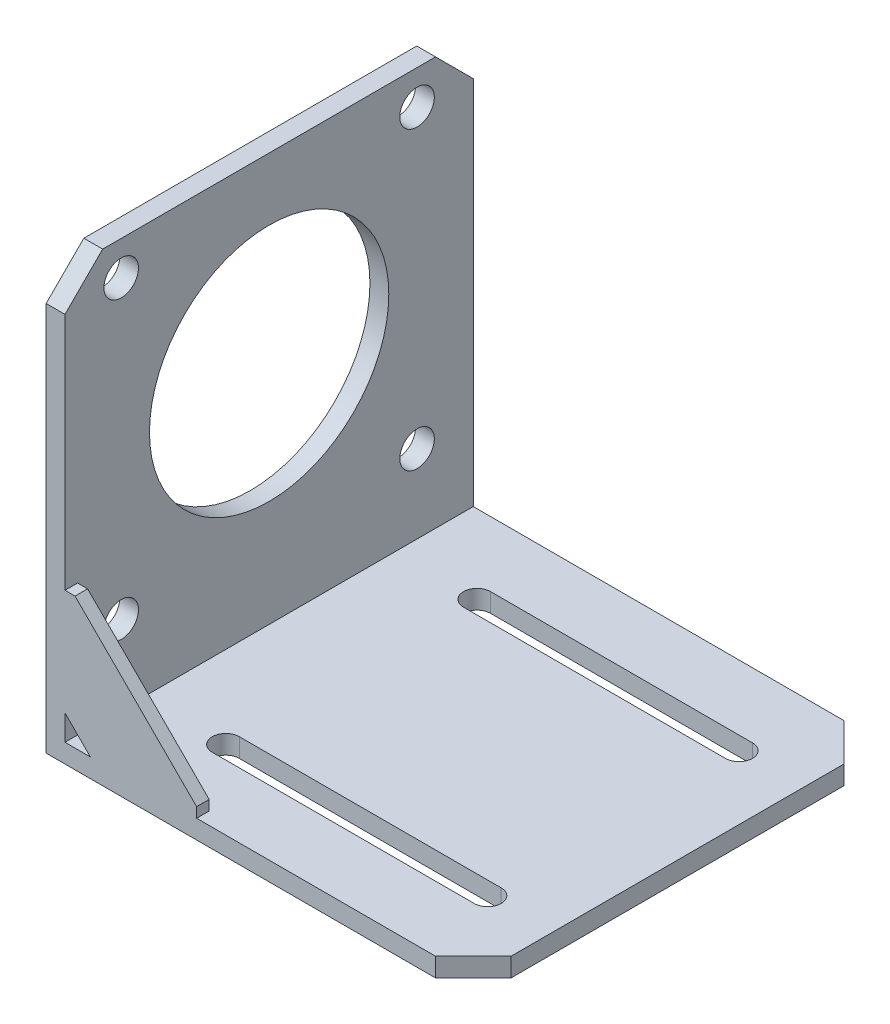
ISO-10303-21;
HEADER;
FILE_DESCRIPTION(('STEP AP214'),'2;1');
FILE_NAME('part.step','',(''),(''),'','','');
FILE_SCHEMA(('AUTOMOTIVE_DESIGN { 1 0 10303 214 1 1 1 1 }'));
ENDSEC;
DATA;
#1=APPLICATION_CONTEXT('core data for automotive mechanical design processes');
#2=APPLICATION_PROTOCOL_DEFINITION('international standard','automotive_design',2000,#1);
#3=PRODUCT_CONTEXT('',#1,'mechanical');
#4=PRODUCT('Part','Part','',(#3));
#5=PRODUCT_RELATED_PRODUCT_CATEGORY('part','',(#4));
#6=PRODUCT_DEFINITION_FORMATION('','',#4);
#7=PRODUCT_DEFINITION_CONTEXT('part definition',#1,'design');
#8=PRODUCT_DEFINITION('design','',#6,#7);
#9=PRODUCT_DEFINITION_SHAPE('','',#8);
#10=(LENGTH_UNIT() NAMED_UNIT(*) SI_UNIT(.MILLI.,.METRE.));
#11=(NAMED_UNIT(*) PLANE_ANGLE_UNIT() SI_UNIT($,.RADIAN.));
#12=(NAMED_UNIT(*) SI_UNIT($,.STERADIAN.) SOLID_ANGLE_UNIT());
#13=UNCERTAINTY_MEASURE_WITH_UNIT(LENGTH_MEASURE(1.E-05),#10,'distance_accuracy_value','');
#14=(GEOMETRIC_REPRESENTATION_CONTEXT(3) GLOBAL_UNCERTAINTY_ASSIGNED_CONTEXT((#13)) GLOBAL_UNIT_ASSIGNED_CONTEXT((#10,
#11,#12)) REPRESENTATION_CONTEXT('',''));
#15=CARTESIAN_POINT('',(0.,0.,0.));
#16=DIRECTION('',(0.,0.,1.));
#17=DIRECTION('',(1.,0.,0.));
#18=AXIS2_PLACEMENT_3D('',#15,#16,#17);
#19=CARTESIAN_POINT('',(68.,0.,65.));
#20=DIRECTION('',(0.,1.,0.));
#21=DIRECTION('',(-1.,0.,0.));
#22=AXIS2_PLACEMENT_3D('',#19,#20,#21);
#23=PLANE('',#22);
#24=DIRECTION('',(1.,0.,0.));
#25=VECTOR('',#24,1.);
#26=CARTESIAN_POINT('',(16.1,0.,10.35));
#27=LINE('',#26,#25);
#28=CARTESIAN_POINT('',(16.1,0.,10.35));
#29=VERTEX_POINT('',#28);
#30=CARTESIAN_POINT('',(57.8,0.,10.35));
#31=VERTEX_POINT('',#30);
#32=EDGE_CURVE('E223',#29,#31,#27,.T.);
#33=ORIENTED_EDGE('',*,*,#32,.F.);
#34=CARTESIAN_POINT('',(16.1,0.,12.5));
#35=DIRECTION('',(0.,-1.,0.));
#36=DIRECTION('',(1.,0.,0.));
#37=AXIS2_PLACEMENT_3D('',#34,#35,#36);
#38=CIRCLE('',#37,2.15);
#39=CARTESIAN_POINT('',(16.1,0.,14.65));
#40=VERTEX_POINT('',#39);
#41=EDGE_CURVE('E51',#40,#29,#38,.T.);
#42=ORIENTED_EDGE('',*,*,#41,.F.);
#43=DIRECTION('',(-1.,0.,0.));
#44=VECTOR('',#43,1.);
#45=CARTESIAN_POINT('',(16.1,0.,14.65));
#46=LINE('',#45,#44);
#47=CARTESIAN_POINT('',(57.8,0.,14.65));
#48=VERTEX_POINT('',#47);
#49=EDGE_CURVE('E214',#48,#40,#46,.T.);
#50=ORIENTED_EDGE('',*,*,#49,.F.);
#51=CARTESIAN_POINT('',(57.8,0.,12.5));
#52=DIRECTION('',(0.,-1.,0.));
#53=DIRECTION('',(1.,0.,0.));
#54=AXIS2_PLACEMENT_3D('',#51,#52,#53);
#55=CIRCLE('',#54,2.15);
#56=EDGE_CURVE('E217',#31,#48,#55,.T.);
#57=ORIENTED_EDGE('',*,*,#56,.F.);
#58=EDGE_LOOP('',(#33,#42,#50,#57));
#59=FACE_BOUND('',#58,.T.);
#60=DIRECTION('',(1.,0.,0.));
#61=VECTOR('',#60,1.);
#62=CARTESIAN_POINT('',(16.1,0.,50.35));
#63=LINE('',#62,#61);
#64=CARTESIAN_POINT('',(16.1,0.,50.35));
#65=VERTEX_POINT('',#64);
#66=CARTESIAN_POINT('',(57.8,0.,50.35));
#67=VERTEX_POINT('',#66);
#68=EDGE_CURVE('E248',#65,#67,#63,.T.);
#69=ORIENTED_EDGE('',*,*,#68,.F.);
#70=CARTESIAN_POINT('',(16.1,0.,52.5));
#71=DIRECTION('',(0.,-1.,0.));
#72=DIRECTION('',(1.,0.,0.));
#73=AXIS2_PLACEMENT_3D('',#70,#71,#72);
#74=CIRCLE('',#73,2.15);
#75=CARTESIAN_POINT('',(16.1,0.,54.65));
#76=VERTEX_POINT('',#75);
#77=EDGE_CURVE('E229',#76,#65,#74,.T.);
#78=ORIENTED_EDGE('',*,*,#77,.F.);
#79=DIRECTION('',(-1.,0.,0.));
#80=VECTOR('',#79,1.);
#81=CARTESIAN_POINT('',(16.1,0.,54.65));
#82=LINE('',#81,#80);
#83=CARTESIAN_POINT('',(57.8,0.,54.65));
#84=VERTEX_POINT('',#83);
#85=EDGE_CURVE('E237',#84,#76,#82,.T.);
#86=ORIENTED_EDGE('',*,*,#85,.F.);
#87=CARTESIAN_POINT('',(57.8,0.,52.5));
#88=DIRECTION('',(0.,-1.,0.));
#89=DIRECTION('',(1.,0.,0.));
#90=AXIS2_PLACEMENT_3D('',#87,#88,#89);
#91=CIRCLE('',#90,2.15);
#92=EDGE_CURVE('E251',#67,#84,#91,.T.);
#93=ORIENTED_EDGE('',*,*,#92,.F.);
#94=EDGE_LOOP('',(#69,#78,#86,#93));
#95=FACE_BOUND('',#94,.T.);
#96=DIRECTION('',(0.,0.,-1.));
#97=VECTOR('',#96,1.);
#98=CARTESIAN_POINT('',(68.,0.,65.));
#99=LINE('',#98,#97);
#100=CARTESIAN_POINT('',(68.,0.,59.));
#101=VERTEX_POINT('',#100);
#102=CARTESIAN_POINT('',(68.,0.,6.));
#103=VERTEX_POINT('',#102);
#104=EDGE_CURVE('E375',#101,#103,#99,.T.);
#105=ORIENTED_EDGE('',*,*,#104,.F.);
#106=DIRECTION('',(0.707106781186546,0.,-0.707106781186549));
#107=VECTOR('',#106,1.);
#108=CARTESIAN_POINT('',(62.,0.,65.));
#109=LINE('',#108,#107);
#110=CARTESIAN_POINT('',(62.,0.,65.));
#111=VERTEX_POINT('',#110);
#112=EDGE_CURVE('E395',#101,#111,#109,.F.);
#113=ORIENTED_EDGE('',*,*,#112,.T.);
#114=DIRECTION('',(1.,0.,0.));
#115=VECTOR('',#114,1.);
#116=CARTESIAN_POINT('',(68.,0.,65.));
#117=LINE('',#116,#115);
#118=CARTESIAN_POINT('',(0.,0.,65.));
#119=VERTEX_POINT('',#118);
#120=EDGE_CURVE('E338',#119,#111,#117,.T.);
#121=ORIENTED_EDGE('',*,*,#120,.F.);
#122=DIRECTION('',(0.,0.,-1.));
#123=VECTOR('',#122,1.);
#124=CARTESIAN_POINT('',(0.,0.,65.));
#125=LINE('',#124,#123);
#126=CARTESIAN_POINT('',(0.,0.,0.));
#127=VERTEX_POINT('',#126);
#128=EDGE_CURVE('E352',#119,#127,#125,.T.);
#129=ORIENTED_EDGE('',*,*,#128,.T.);
#130=DIRECTION('',(1.,0.,0.));
#131=VECTOR('',#130,1.);
#132=CARTESIAN_POINT('',(68.,0.,0.));
#133=LINE('',#132,#131);
#134=CARTESIAN_POINT('',(62.,0.,0.));
#135=VERTEX_POINT('',#134);
#136=EDGE_CURVE('E325',#127,#135,#133,.T.);
#137=ORIENTED_EDGE('',*,*,#136,.T.);
#138=DIRECTION('',(0.70710678118655,0.,0.707106781186546));
#139=VECTOR('',#138,1.);
#140=CARTESIAN_POINT('',(68.,0.,6.));
#141=LINE('',#140,#139);
#142=EDGE_CURVE('E393',#135,#103,#141,.T.);
#143=ORIENTED_EDGE('',*,*,#142,.T.);
#144=EDGE_LOOP('',(#105,#113,#121,#129,#137,#143));
#145=FACE_BOUND('',#144,.T.);
#146=ADVANCED_FACE('F36',(#59,#95,#145),#23,.F.);
#147=CARTESIAN_POINT('',(68.,3.,65.));
#148=DIRECTION('',(-1.,0.,0.));
#149=DIRECTION('',(0.,-1.,0.));
#150=AXIS2_PLACEMENT_3D('',#147,#148,#149);
#151=PLANE('',#150);
#152=DIRECTION('',(0.,0.,-1.));
#153=VECTOR('',#152,1.);
#154=CARTESIAN_POINT('',(68.,3.,65.));
#155=LINE('',#154,#153);
#156=CARTESIAN_POINT('',(68.,3.,59.));
#157=VERTEX_POINT('',#156);
#158=CARTESIAN_POINT('',(68.,3.,6.));
#159=VERTEX_POINT('',#158);
#160=EDGE_CURVE('E372',#157,#159,#155,.T.);
#161=ORIENTED_EDGE('',*,*,#160,.F.);
#162=DIRECTION('',(0.,-1.,0.));
#163=VECTOR('',#162,1.);
#164=CARTESIAN_POINT('',(68.,3.,59.));
#165=LINE('',#164,#163);
#166=EDGE_CURVE('E391',#157,#101,#165,.T.);
#167=ORIENTED_EDGE('',*,*,#166,.T.);
#168=ORIENTED_EDGE('',*,*,#104,.T.);
#169=DIRECTION('',(0.,1.,0.));
#170=VECTOR('',#169,1.);
#171=CARTESIAN_POINT('',(68.,3.,5.99999999999999));
#172=LINE('',#171,#170);
#173=EDGE_CURVE('E388',#103,#159,#172,.T.);
#174=ORIENTED_EDGE('',*,*,#173,.T.);
#175=EDGE_LOOP('',(#161,#167,#168,#174));
#176=FACE_BOUND('',#175,.T.);
#177=ADVANCED_FACE('F441',(#176),#151,.F.);
#178=CARTESIAN_POINT('',(3.,3.,65.));
#179=DIRECTION('',(0.,-1.,0.));
#180=DIRECTION('',(1.,0.,0.));
#181=AXIS2_PLACEMENT_3D('',#178,#179,#180);
#182=PLANE('',#181);
#183=DIRECTION('',(-1.,0.,0.));
#184=VECTOR('',#183,1.);
#185=CARTESIAN_POINT('',(16.1,3.,14.65));
#186=LINE('',#185,#184);
#187=CARTESIAN_POINT('',(57.8,3.,14.65));
#188=VERTEX_POINT('',#187);
#189=CARTESIAN_POINT('',(16.1,3.,14.65));
#190=VERTEX_POINT('',#189);
#191=EDGE_CURVE('E204',#188,#190,#186,.T.);
#192=ORIENTED_EDGE('',*,*,#191,.T.);
#193=CARTESIAN_POINT('',(16.1,3.,12.5));
#194=DIRECTION('',(0.,-1.,0.));
#195=DIRECTION('',(1.,0.,0.));
#196=AXIS2_PLACEMENT_3D('',#193,#194,#195);
#197=CIRCLE('',#196,2.15);
#198=CARTESIAN_POINT('',(16.1,3.,10.35));
#199=VERTEX_POINT('',#198);
#200=EDGE_CURVE('E198',#190,#199,#197,.T.);
#201=ORIENTED_EDGE('',*,*,#200,.T.);
#202=DIRECTION('',(1.,0.,0.));
#203=VECTOR('',#202,1.);
#204=CARTESIAN_POINT('',(16.1,3.,10.35));
#205=LINE('',#204,#203);
#206=CARTESIAN_POINT('',(57.8,3.,10.35));
#207=VERTEX_POINT('',#206);
#208=EDGE_CURVE('E207',#199,#207,#205,.T.);
#209=ORIENTED_EDGE('',*,*,#208,.T.);
#210=CARTESIAN_POINT('',(57.8,3.,12.5));
#211=DIRECTION('',(0.,-1.,0.));
#212=DIRECTION('',(1.,0.,0.));
#213=AXIS2_PLACEMENT_3D('',#210,#211,#212);
#214=CIRCLE('',#213,2.15);
#215=EDGE_CURVE('E59',#207,#188,#214,.T.);
#216=ORIENTED_EDGE('',*,*,#215,.T.);
#217=EDGE_LOOP('',(#192,#201,#209,#216));
#218=FACE_BOUND('',#217,.T.);
#219=DIRECTION('',(-1.,0.,0.));
#220=VECTOR('',#219,1.);
#221=CARTESIAN_POINT('',(16.1,3.,54.65));
#222=LINE('',#221,#220);
#223=CARTESIAN_POINT('',(57.8,3.,54.65));
#224=VERTEX_POINT('',#223);
#225=CARTESIAN_POINT('',(16.1,3.,54.65));
#226=VERTEX_POINT('',#225);
#227=EDGE_CURVE('E243',#224,#226,#222,.T.);
#228=ORIENTED_EDGE('',*,*,#227,.T.);
#229=CARTESIAN_POINT('',(16.1,3.,52.5));
#230=DIRECTION('',(0.,-1.,0.));
#231=DIRECTION('',(1.,0.,0.));
#232=AXIS2_PLACEMENT_3D('',#229,#230,#231);
#233=CIRCLE('',#232,2.15);
#234=CARTESIAN_POINT('',(16.1,3.,50.35));
#235=VERTEX_POINT('',#234);
#236=EDGE_CURVE('E233',#226,#235,#233,.T.);
#237=ORIENTED_EDGE('',*,*,#236,.T.);
#238=DIRECTION('',(1.,0.,0.));
#239=VECTOR('',#238,1.);
#240=CARTESIAN_POINT('',(16.1,3.,50.35));
#241=LINE('',#240,#239);
#242=CARTESIAN_POINT('',(57.8,3.,50.35));
#243=VERTEX_POINT('',#242);
#244=EDGE_CURVE('E236',#235,#243,#241,.T.);
#245=ORIENTED_EDGE('',*,*,#244,.T.);
#246=CARTESIAN_POINT('',(57.8,3.,52.5));
#247=DIRECTION('',(0.,-1.,0.));
#248=DIRECTION('',(1.,0.,0.));
#249=AXIS2_PLACEMENT_3D('',#246,#247,#248);
#250=CIRCLE('',#249,2.15);
#251=EDGE_CURVE('E240',#243,#224,#250,.T.);
#252=ORIENTED_EDGE('',*,*,#251,.T.);
#253=EDGE_LOOP('',(#228,#237,#245,#252));
#254=FACE_BOUND('',#253,.T.);
#255=DIRECTION('',(-1.,0.,0.));
#256=VECTOR('',#255,1.);
#257=CARTESIAN_POINT('',(3.,3.,65.));
#258=LINE('',#257,#256);
#259=CARTESIAN_POINT('',(7.04782201567098,3.,65.));
#260=VERTEX_POINT('',#259);
#261=CARTESIAN_POINT('',(3.,3.,65.));
#262=VERTEX_POINT('',#261);
#263=EDGE_CURVE('E341',#260,#262,#258,.T.);
#264=ORIENTED_EDGE('',*,*,#263,.F.);
#265=DIRECTION('',(0.,0.,1.));
#266=VECTOR('',#265,1.);
#267=CARTESIAN_POINT('',(7.04782201567098,3.00000000000002,63.));
#268=LINE('',#267,#266);
#269=CARTESIAN_POINT('',(7.04782201567098,3.00000000000002,63.));
#270=VERTEX_POINT('',#269);
#271=EDGE_CURVE('E313',#270,#260,#268,.T.);
#272=ORIENTED_EDGE('',*,*,#271,.F.);
#273=DIRECTION('',(1.,0.,0.));
#274=VECTOR('',#273,1.);
#275=CARTESIAN_POINT('',(23.9558780924768,3.00000000000002,63.));
#276=LINE('',#275,#274);
#277=CARTESIAN_POINT('',(23.9558780924768,3.00000000000002,63.));
#278=VERTEX_POINT('',#277);
#279=EDGE_CURVE('E298',#270,#278,#276,.T.);
#280=ORIENTED_EDGE('',*,*,#279,.T.);
#281=DIRECTION('',(0.,0.,1.));
#282=VECTOR('',#281,1.);
#283=CARTESIAN_POINT('',(23.9558780924768,3.00000000000002,63.));
#284=LINE('',#283,#282);
#285=CARTESIAN_POINT('',(23.9558780924768,3.00000000000002,65.));
#286=VERTEX_POINT('',#285);
#287=EDGE_CURVE('E333',#278,#286,#284,.T.);
#288=ORIENTED_EDGE('',*,*,#287,.T.);
#289=CARTESIAN_POINT('',(62.,3.,65.));
#290=VERTEX_POINT('',#289);
#291=EDGE_CURVE('E343',#290,#286,#258,.T.);
#292=ORIENTED_EDGE('',*,*,#291,.F.);
#293=DIRECTION('',(-0.707106781186546,0.,0.707106781186549));
#294=VECTOR('',#293,1.);
#295=CARTESIAN_POINT('',(62.,3.,65.));
#296=LINE('',#295,#294);
#297=EDGE_CURVE('E386',#290,#157,#296,.F.);
#298=ORIENTED_EDGE('',*,*,#297,.T.);
#299=ORIENTED_EDGE('',*,*,#160,.T.);
#300=DIRECTION('',(-0.70710678118655,0.,-0.707106781186546));
#301=VECTOR('',#300,1.);
#302=CARTESIAN_POINT('',(68.,3.,5.99999999999999));
#303=LINE('',#302,#301);
#304=CARTESIAN_POINT('',(62.,3.,0.));
#305=VERTEX_POINT('',#304);
#306=EDGE_CURVE('E384',#159,#305,#303,.T.);
#307=ORIENTED_EDGE('',*,*,#306,.T.);
#308=DIRECTION('',(-1.,0.,0.));
#309=VECTOR('',#308,1.);
#310=CARTESIAN_POINT('',(3.,3.,0.));
#311=LINE('',#310,#309);
#312=CARTESIAN_POINT('',(3.,3.,0.));
#313=VERTEX_POINT('',#312);
#314=EDGE_CURVE('E355',#305,#313,#311,.T.);
#315=ORIENTED_EDGE('',*,*,#314,.T.);
#316=DIRECTION('',(0.,0.,-1.));
#317=VECTOR('',#316,1.);
#318=CARTESIAN_POINT('',(3.,3.,65.));
#319=LINE('',#318,#317);
#320=EDGE_CURVE('E369',#262,#313,#319,.T.);
#321=ORIENTED_EDGE('',*,*,#320,.F.);
#322=EDGE_LOOP('',(#264,#272,#280,#288,#292,#298,#299,#307,#315,#321));
#323=FACE_BOUND('',#322,.T.);
#324=ADVANCED_FACE('F211',(#218,#254,#323),#182,.F.);
#325=CARTESIAN_POINT('',(3.,68.,65.));
#326=DIRECTION('',(-1.,0.,0.));
#327=DIRECTION('',(0.,-1.,0.));
#328=AXIS2_PLACEMENT_3D('',#325,#326,#327);
#329=PLANE('',#328);
#330=CARTESIAN_POINT('',(3.,15.45,56.05));
#331=DIRECTION('',(-1.,0.,0.));
#332=DIRECTION('',(0.,0.,1.));
#333=AXIS2_PLACEMENT_3D('',#330,#331,#332);
#334=CIRCLE('',#333,2.75);
#335=CARTESIAN_POINT('',(3.,15.45,58.8));
#336=VERTEX_POINT('',#335);
#337=EDGE_CURVE('E265',#336,#336,#334,.T.);
#338=ORIENTED_EDGE('',*,*,#337,.T.);
#339=EDGE_LOOP('',(#338));
#340=FACE_BOUND('',#339,.T.);
#341=CARTESIAN_POINT('',(3.,15.45,8.94999999999999));
#342=DIRECTION('',(-1.,0.,0.));
#343=DIRECTION('',(0.,0.,1.));
#344=AXIS2_PLACEMENT_3D('',#341,#342,#343);
#345=CIRCLE('',#344,2.75);
#346=CARTESIAN_POINT('',(3.,15.45,11.7));
#347=VERTEX_POINT('',#346);
#348=EDGE_CURVE('E271',#347,#347,#345,.T.);
#349=ORIENTED_EDGE('',*,*,#348,.T.);
#350=EDGE_LOOP('',(#349));
#351=FACE_BOUND('',#350,.T.);
#352=CARTESIAN_POINT('',(3.,62.55,56.05));
#353=DIRECTION('',(-1.,0.,0.));
#354=DIRECTION('',(0.,0.,1.));
#355=AXIS2_PLACEMENT_3D('',#352,#353,#354);
#356=CIRCLE('',#355,2.75);
#357=CARTESIAN_POINT('',(3.,62.55,58.8));
#358=VERTEX_POINT('',#357);
#359=EDGE_CURVE('E277',#358,#358,#356,.T.);
#360=ORIENTED_EDGE('',*,*,#359,.T.);
#361=EDGE_LOOP('',(#360));
#362=FACE_BOUND('',#361,.T.);
#363=CARTESIAN_POINT('',(3.,62.55,8.94999999999998));
#364=DIRECTION('',(-1.,0.,0.));
#365=DIRECTION('',(0.,0.,1.));
#366=AXIS2_PLACEMENT_3D('',#363,#364,#365);
#367=CIRCLE('',#366,2.75);
#368=CARTESIAN_POINT('',(3.,62.55,11.7));
#369=VERTEX_POINT('',#368);
#370=EDGE_CURVE('E283',#369,#369,#367,.T.);
#371=ORIENTED_EDGE('',*,*,#370,.T.);
#372=EDGE_LOOP('',(#371));
#373=FACE_BOUND('',#372,.T.);
#374=CARTESIAN_POINT('',(3.,39.,32.5));
#375=DIRECTION('',(-1.,0.,0.));
#376=DIRECTION('',(0.,0.,1.));
#377=AXIS2_PLACEMENT_3D('',#374,#375,#376);
#378=CIRCLE('',#377,19.05);
#379=CARTESIAN_POINT('',(3.,39.,51.55));
#380=VERTEX_POINT('',#379);
#381=EDGE_CURVE('E289',#380,#380,#378,.T.);
#382=ORIENTED_EDGE('',*,*,#381,.T.);
#383=EDGE_LOOP('',(#382));
#384=FACE_BOUND('',#383,.T.);
#385=DIRECTION('',(0.,-1.,0.));
#386=VECTOR('',#385,1.);
#387=CARTESIAN_POINT('',(3.,7.04782201567103,63.));
#388=LINE('',#387,#386);
#389=CARTESIAN_POINT('',(3.00000000000002,23.9558780924771,63.));
#390=VERTEX_POINT('',#389);
#391=CARTESIAN_POINT('',(3.,7.04782201567103,63.));
#392=VERTEX_POINT('',#391);
#393=EDGE_CURVE('E310',#390,#392,#388,.T.);
#394=ORIENTED_EDGE('',*,*,#393,.T.);
#395=DIRECTION('',(0.,0.,1.));
#396=VECTOR('',#395,1.);
#397=CARTESIAN_POINT('',(3.,7.04782201567103,63.));
#398=LINE('',#397,#396);
#399=CARTESIAN_POINT('',(3.,7.04782201567103,65.));
#400=VERTEX_POINT('',#399);
#401=EDGE_CURVE('E322',#392,#400,#398,.T.);
#402=ORIENTED_EDGE('',*,*,#401,.T.);
#403=DIRECTION('',(0.,1.,0.));
#404=VECTOR('',#403,1.);
#405=CARTESIAN_POINT('',(3.,68.,65.));
#406=LINE('',#405,#404);
#407=EDGE_CURVE('E347',#262,#400,#406,.T.);
#408=ORIENTED_EDGE('',*,*,#407,.F.);
#409=ORIENTED_EDGE('',*,*,#320,.T.);
#410=DIRECTION('',(0.,1.,0.));
#411=VECTOR('',#410,1.);
#412=CARTESIAN_POINT('',(3.,68.,0.));
#413=LINE('',#412,#411);
#414=CARTESIAN_POINT('',(3.,62.,0.));
#415=VERTEX_POINT('',#414);
#416=EDGE_CURVE('E357',#313,#415,#413,.T.);
#417=ORIENTED_EDGE('',*,*,#416,.T.);
#418=DIRECTION('',(0.,0.70710678118655,0.707106781186546));
#419=VECTOR('',#418,1.);
#420=CARTESIAN_POINT('',(3.,68.,5.99999999999999));
#421=LINE('',#420,#419);
#422=CARTESIAN_POINT('',(3.,68.,6.));
#423=VERTEX_POINT('',#422);
#424=EDGE_CURVE('E11',#415,#423,#421,.T.);
#425=ORIENTED_EDGE('',*,*,#424,.T.);
#426=DIRECTION('',(0.,0.,-1.));
#427=VECTOR('',#426,1.);
#428=CARTESIAN_POINT('',(3.,68.,65.));
#429=LINE('',#428,#427);
#430=CARTESIAN_POINT('',(3.,68.,59.));
#431=VERTEX_POINT('',#430);
#432=EDGE_CURVE('E366',#431,#423,#429,.T.);
#433=ORIENTED_EDGE('',*,*,#432,.F.);
#434=DIRECTION('',(0.,0.707106781186545,-0.70710678118655));
#435=VECTOR('',#434,1.);
#436=CARTESIAN_POINT('',(3.,62.,65.));
#437=LINE('',#436,#435);
#438=CARTESIAN_POINT('',(3.,62.,65.));
#439=VERTEX_POINT('',#438);
#440=EDGE_CURVE('E44',#431,#439,#437,.F.);
#441=ORIENTED_EDGE('',*,*,#440,.T.);
#442=CARTESIAN_POINT('',(3.,23.955878092477,65.));
#443=VERTEX_POINT('',#442);
#444=EDGE_CURVE('E346',#443,#439,#406,.T.);
#445=ORIENTED_EDGE('',*,*,#444,.F.);
#446=DIRECTION('',(0.,0.,1.));
#447=VECTOR('',#446,1.);
#448=CARTESIAN_POINT('',(3.00000000000002,23.9558780924771,63.));
#449=LINE('',#448,#447);
#450=EDGE_CURVE('E326',#390,#443,#449,.T.);
#451=ORIENTED_EDGE('',*,*,#450,.F.);
#452=EDGE_LOOP('',(#394,#402,#408,#409,#417,#425,#433,#441,#445,#451));
#453=FACE_BOUND('',#452,.T.);
#454=ADVANCED_FACE('F415',(#340,#351,#362,#373,#384,#453),#329,.F.);
#455=CARTESIAN_POINT('',(0.,68.,65.));
#456=DIRECTION('',(0.,-1.,0.));
#457=DIRECTION('',(0.,0.,-1.));
#458=AXIS2_PLACEMENT_3D('',#455,#456,#457);
#459=PLANE('',#458);
#460=ORIENTED_EDGE('',*,*,#432,.T.);
#461=DIRECTION('',(-1.,0.,0.));
#462=VECTOR('',#461,1.);
#463=CARTESIAN_POINT('',(0.,68.,5.99999999999999));
#464=LINE('',#463,#462);
#465=CARTESIAN_POINT('',(0.,68.,6.));
#466=VERTEX_POINT('',#465);
#467=EDGE_CURVE('E403',#423,#466,#464,.T.);
#468=ORIENTED_EDGE('',*,*,#467,.T.);
#469=DIRECTION('',(0.,0.,-1.));
#470=VECTOR('',#469,1.);
#471=CARTESIAN_POINT('',(0.,68.,65.));
#472=LINE('',#471,#470);
#473=CARTESIAN_POINT('',(0.,68.,59.));
#474=VERTEX_POINT('',#473);
#475=EDGE_CURVE('E363',#474,#466,#472,.T.);
#476=ORIENTED_EDGE('',*,*,#475,.F.);
#477=DIRECTION('',(1.,0.,0.));
#478=VECTOR('',#477,1.);
#479=CARTESIAN_POINT('',(0.,68.,59.));
#480=LINE('',#479,#478);
#481=EDGE_CURVE('E401',#474,#431,#480,.T.);
#482=ORIENTED_EDGE('',*,*,#481,.T.);
#483=EDGE_LOOP('',(#460,#468,#476,#482));
#484=FACE_BOUND('',#483,.T.);
#485=ADVANCED_FACE('F459',(#484),#459,.F.);
#486=CARTESIAN_POINT('',(0.,0.,65.));
#487=DIRECTION('',(1.,0.,0.));
#488=DIRECTION('',(0.,0.,-1.));
#489=AXIS2_PLACEMENT_3D('',#486,#487,#488);
#490=PLANE('',#489);
#491=CARTESIAN_POINT('',(0.,15.45,56.05));
#492=DIRECTION('',(-1.,0.,0.));
#493=DIRECTION('',(0.,0.,1.));
#494=AXIS2_PLACEMENT_3D('',#491,#492,#493);
#495=CIRCLE('',#494,2.75);
#496=CARTESIAN_POINT('',(0.,15.45,58.8));
#497=VERTEX_POINT('',#496);
#498=EDGE_CURVE('E258',#497,#497,#495,.T.);
#499=ORIENTED_EDGE('',*,*,#498,.F.);
#500=EDGE_LOOP('',(#499));
#501=FACE_BOUND('',#500,.T.);
#502=CARTESIAN_POINT('',(0.,15.45,8.94999999999999));
#503=DIRECTION('',(-1.,0.,0.));
#504=DIRECTION('',(0.,0.,1.));
#505=AXIS2_PLACEMENT_3D('',#502,#503,#504);
#506=CIRCLE('',#505,2.75);
#507=CARTESIAN_POINT('',(0.,15.45,11.7));
#508=VERTEX_POINT('',#507);
#509=EDGE_CURVE('E268',#508,#508,#506,.T.);
#510=ORIENTED_EDGE('',*,*,#509,.F.);
#511=EDGE_LOOP('',(#510));
#512=FACE_BOUND('',#511,.T.);
#513=CARTESIAN_POINT('',(0.,62.55,56.05));
#514=DIRECTION('',(-1.,0.,0.));
#515=DIRECTION('',(0.,0.,1.));
#516=AXIS2_PLACEMENT_3D('',#513,#514,#515);
#517=CIRCLE('',#516,2.75);
#518=CARTESIAN_POINT('',(0.,62.55,58.8));
#519=VERTEX_POINT('',#518);
#520=EDGE_CURVE('E274',#519,#519,#517,.T.);
#521=ORIENTED_EDGE('',*,*,#520,.F.);
#522=EDGE_LOOP('',(#521));
#523=FACE_BOUND('',#522,.T.);
#524=CARTESIAN_POINT('',(0.,62.55,8.94999999999998));
#525=DIRECTION('',(-1.,0.,0.));
#526=DIRECTION('',(0.,0.,1.));
#527=AXIS2_PLACEMENT_3D('',#524,#525,#526);
#528=CIRCLE('',#527,2.75);
#529=CARTESIAN_POINT('',(0.,62.55,11.7));
#530=VERTEX_POINT('',#529);
#531=EDGE_CURVE('E280',#530,#530,#528,.T.);
#532=ORIENTED_EDGE('',*,*,#531,.F.);
#533=EDGE_LOOP('',(#532));
#534=FACE_BOUND('',#533,.T.);
#535=CARTESIAN_POINT('',(0.,39.,32.5));
#536=DIRECTION('',(-1.,0.,0.));
#537=DIRECTION('',(0.,0.,1.));
#538=AXIS2_PLACEMENT_3D('',#535,#536,#537);
#539=CIRCLE('',#538,19.05);
#540=CARTESIAN_POINT('',(0.,39.,51.55));
#541=VERTEX_POINT('',#540);
#542=EDGE_CURVE('E286',#541,#541,#539,.T.);
#543=ORIENTED_EDGE('',*,*,#542,.F.);
#544=EDGE_LOOP('',(#543));
#545=FACE_BOUND('',#544,.T.);
#546=ORIENTED_EDGE('',*,*,#475,.T.);
#547=DIRECTION('',(0.,-0.70710678118655,-0.707106781186546));
#548=VECTOR('',#547,1.);
#549=CARTESIAN_POINT('',(0.,68.,5.99999999999999));
#550=LINE('',#549,#548);
#551=CARTESIAN_POINT('',(0.,62.,0.));
#552=VERTEX_POINT('',#551);
#553=EDGE_CURVE('E408',#466,#552,#550,.T.);
#554=ORIENTED_EDGE('',*,*,#553,.T.);
#555=DIRECTION('',(0.,-1.,0.));
#556=VECTOR('',#555,1.);
#557=CARTESIAN_POINT('',(0.,0.,0.));
#558=LINE('',#557,#556);
#559=EDGE_CURVE('E342',#552,#127,#558,.T.);
#560=ORIENTED_EDGE('',*,*,#559,.T.);
#561=ORIENTED_EDGE('',*,*,#128,.F.);
#562=DIRECTION('',(0.,-1.,0.));
#563=VECTOR('',#562,1.);
#564=CARTESIAN_POINT('',(0.,0.,65.));
#565=LINE('',#564,#563);
#566=CARTESIAN_POINT('',(0.,62.,65.));
#567=VERTEX_POINT('',#566);
#568=EDGE_CURVE('E350',#567,#119,#565,.T.);
#569=ORIENTED_EDGE('',*,*,#568,.F.);
#570=DIRECTION('',(0.,-0.707106781186545,0.70710678118655));
#571=VECTOR('',#570,1.);
#572=CARTESIAN_POINT('',(0.,62.,65.));
#573=LINE('',#572,#571);
#574=EDGE_CURVE('E406',#567,#474,#573,.F.);
#575=ORIENTED_EDGE('',*,*,#574,.T.);
#576=EDGE_LOOP('',(#546,#554,#560,#561,#569,#575));
#577=FACE_BOUND('',#576,.T.);
#578=ADVANCED_FACE('F424',(#501,#512,#523,#534,#545,#577),#490,.F.);
#579=CARTESIAN_POINT('',(0.,0.,65.));
#580=DIRECTION('',(0.,0.,-1.));
#581=DIRECTION('',(-1.,0.,0.));
#582=AXIS2_PLACEMENT_3D('',#579,#580,#581);
#583=PLANE('',#582);
#584=ORIENTED_EDGE('',*,*,#407,.T.);
#585=DIRECTION('',(0.707106781186545,-0.70710678118655,0.));
#586=VECTOR('',#585,1.);
#587=CARTESIAN_POINT('',(3.,7.04782201567103,65.));
#588=LINE('',#587,#586);
#589=EDGE_CURVE('E292',#400,#260,#588,.T.);
#590=ORIENTED_EDGE('',*,*,#589,.T.);
#591=ORIENTED_EDGE('',*,*,#263,.T.);
#592=EDGE_LOOP('',(#584,#590,#591));
#593=FACE_BOUND('',#592,.T.);
#594=ORIENTED_EDGE('',*,*,#120,.T.);
#595=DIRECTION('',(0.,1.,0.));
#596=VECTOR('',#595,1.);
#597=CARTESIAN_POINT('',(62.,-2.86807614694832E-13,65.));
#598=LINE('',#597,#596);
#599=EDGE_CURVE('E381',#111,#290,#598,.T.);
#600=ORIENTED_EDGE('',*,*,#599,.T.);
#601=ORIENTED_EDGE('',*,*,#291,.T.);
#602=DIRECTION('',(0.,1.,0.));
#603=VECTOR('',#602,1.);
#604=CARTESIAN_POINT('',(23.9558780924768,4.60018500711891,65.));
#605=LINE('',#604,#603);
#606=CARTESIAN_POINT('',(23.9558780924768,4.60018500711891,65.));
#607=VERTEX_POINT('',#606);
#608=EDGE_CURVE('E315',#286,#607,#605,.T.);
#609=ORIENTED_EDGE('',*,*,#608,.T.);
#610=DIRECTION('',(-0.707106781186544,0.707106781186551,0.));
#611=VECTOR('',#610,1.);
#612=CARTESIAN_POINT('',(4.60018500711891,23.955878092477,65.));
#613=LINE('',#612,#611);
#614=CARTESIAN_POINT('',(4.60018500711891,23.955878092477,65.));
#615=VERTEX_POINT('',#614);
#616=EDGE_CURVE('E318',#607,#615,#613,.T.);
#617=ORIENTED_EDGE('',*,*,#616,.T.);
#618=DIRECTION('',(-1.,0.,0.));
#619=VECTOR('',#618,1.);
#620=CARTESIAN_POINT('',(4.60018500711891,23.955878092477,65.));
#621=LINE('',#620,#619);
#622=EDGE_CURVE('E299',#615,#443,#621,.T.);
#623=ORIENTED_EDGE('',*,*,#622,.T.);
#624=ORIENTED_EDGE('',*,*,#444,.T.);
#625=DIRECTION('',(-1.,0.,0.));
#626=VECTOR('',#625,1.);
#627=CARTESIAN_POINT('',(0.,62.,65.));
#628=LINE('',#627,#626);
#629=EDGE_CURVE('E378',#439,#567,#628,.T.);
#630=ORIENTED_EDGE('',*,*,#629,.T.);
#631=ORIENTED_EDGE('',*,*,#568,.T.);
#632=EDGE_LOOP('',(#594,#600,#601,#609,#617,#623,#624,#630,#631));
#633=FACE_BOUND('',#632,.T.);
#634=ADVANCED_FACE('F421',(#593,#633),#583,.F.);
#635=CARTESIAN_POINT('',(0.,0.,0.));
#636=DIRECTION('',(0.,0.,-1.));
#637=DIRECTION('',(-1.,0.,0.));
#638=AXIS2_PLACEMENT_3D('',#635,#636,#637);
#639=PLANE('',#638);
#640=ORIENTED_EDGE('',*,*,#314,.F.);
#641=DIRECTION('',(0.,-1.,0.));
#642=VECTOR('',#641,1.);
#643=CARTESIAN_POINT('',(62.,0.,0.));
#644=LINE('',#643,#642);
#645=EDGE_CURVE('E399',#305,#135,#644,.T.);
#646=ORIENTED_EDGE('',*,*,#645,.T.);
#647=ORIENTED_EDGE('',*,*,#136,.F.);
#648=ORIENTED_EDGE('',*,*,#559,.F.);
#649=DIRECTION('',(1.,0.,0.));
#650=VECTOR('',#649,1.);
#651=CARTESIAN_POINT('',(3.,62.,0.));
#652=LINE('',#651,#650);
#653=EDGE_CURVE('E397',#552,#415,#652,.T.);
#654=ORIENTED_EDGE('',*,*,#653,.T.);
#655=ORIENTED_EDGE('',*,*,#416,.F.);
#656=EDGE_LOOP('',(#640,#646,#647,#648,#654,#655));
#657=FACE_BOUND('',#656,.T.);
#658=ADVANCED_FACE('F451',(#657),#639,.T.);
#659=CARTESIAN_POINT('',(62.,-2.86807614694832E-13,65.));
#660=DIRECTION('',(-0.707106781186549,0.,-0.707106781186546));
#661=DIRECTION('',(0.,1.,0.));
#662=AXIS2_PLACEMENT_3D('',#659,#660,#661);
#663=PLANE('',#662);
#664=ORIENTED_EDGE('',*,*,#112,.F.);
#665=ORIENTED_EDGE('',*,*,#166,.F.);
#666=ORIENTED_EDGE('',*,*,#297,.F.);
#667=ORIENTED_EDGE('',*,*,#599,.F.);
#668=EDGE_LOOP('',(#664,#665,#666,#667));
#669=FACE_BOUND('',#668,.T.);
#670=ADVANCED_FACE('F435',(#669),#663,.F.);
#671=CARTESIAN_POINT('',(68.,3.,5.99999999999999));
#672=DIRECTION('',(0.707106781186546,0.,-0.70710678118655));
#673=DIRECTION('',(0.,-1.,0.));
#674=AXIS2_PLACEMENT_3D('',#671,#672,#673);
#675=PLANE('',#674);
#676=ORIENTED_EDGE('',*,*,#142,.F.);
#677=ORIENTED_EDGE('',*,*,#645,.F.);
#678=ORIENTED_EDGE('',*,*,#306,.F.);
#679=ORIENTED_EDGE('',*,*,#173,.F.);
#680=EDGE_LOOP('',(#676,#677,#678,#679));
#681=FACE_BOUND('',#680,.T.);
#682=ADVANCED_FACE('F445',(#681),#675,.T.);
#683=CARTESIAN_POINT('',(0.,68.,5.99999999999999));
#684=DIRECTION('',(0.,0.707106781186546,-0.70710678118655));
#685=DIRECTION('',(1.,0.,0.));
#686=AXIS2_PLACEMENT_3D('',#683,#684,#685);
#687=PLANE('',#686);
#688=ORIENTED_EDGE('',*,*,#424,.F.);
#689=ORIENTED_EDGE('',*,*,#653,.F.);
#690=ORIENTED_EDGE('',*,*,#553,.F.);
#691=ORIENTED_EDGE('',*,*,#467,.F.);
#692=EDGE_LOOP('',(#688,#689,#690,#691));
#693=FACE_BOUND('',#692,.T.);
#694=ADVANCED_FACE('F457',(#693),#687,.T.);
#695=CARTESIAN_POINT('',(0.,62.,65.));
#696=DIRECTION('',(0.,-0.70710678118655,-0.707106781186545));
#697=DIRECTION('',(-1.,0.,0.));
#698=AXIS2_PLACEMENT_3D('',#695,#696,#697);
#699=PLANE('',#698);
#700=ORIENTED_EDGE('',*,*,#440,.F.);
#701=ORIENTED_EDGE('',*,*,#481,.F.);
#702=ORIENTED_EDGE('',*,*,#574,.F.);
#703=ORIENTED_EDGE('',*,*,#629,.F.);
#704=EDGE_LOOP('',(#700,#701,#702,#703));
#705=FACE_BOUND('',#704,.T.);
#706=ADVANCED_FACE('F38',(#705),#699,.F.);
#707=CARTESIAN_POINT('',(3.,7.04782201567103,63.));
#708=DIRECTION('',(-0.70710678118655,-0.707106781186545,0.));
#709=DIRECTION('',(0.707106781186545,-0.70710678118655,0.));
#710=AXIS2_PLACEMENT_3D('',#707,#708,#709);
#711=PLANE('',#710);
#712=ORIENTED_EDGE('',*,*,#589,.F.);
#713=ORIENTED_EDGE('',*,*,#401,.F.);
#714=DIRECTION('',(0.707106781186545,-0.70710678118655,0.));
#715=VECTOR('',#714,1.);
#716=CARTESIAN_POINT('',(3.,7.04782201567103,63.));
#717=LINE('',#716,#715);
#718=EDGE_CURVE('E295',#392,#270,#717,.T.);
#719=ORIENTED_EDGE('',*,*,#718,.T.);
#720=ORIENTED_EDGE('',*,*,#271,.T.);
#721=EDGE_LOOP('',(#712,#713,#719,#720));
#722=FACE_BOUND('',#721,.T.);
#723=ADVANCED_FACE('F487',(#722),#711,.T.);
#724=CARTESIAN_POINT('',(4.60018500711891,23.955878092477,63.));
#725=DIRECTION('',(0.,1.,0.));
#726=DIRECTION('',(-1.,0.,0.));
#727=AXIS2_PLACEMENT_3D('',#724,#725,#726);
#728=PLANE('',#727);
#729=ORIENTED_EDGE('',*,*,#622,.F.);
#730=DIRECTION('',(0.,0.,1.));
#731=VECTOR('',#730,1.);
#732=CARTESIAN_POINT('',(4.60018500711891,23.955878092477,63.));
#733=LINE('',#732,#731);
#734=CARTESIAN_POINT('',(4.60018500711891,23.955878092477,63.));
#735=VERTEX_POINT('',#734);
#736=EDGE_CURVE('E329',#735,#615,#733,.T.);
#737=ORIENTED_EDGE('',*,*,#736,.F.);
#738=DIRECTION('',(-1.,0.,0.));
#739=VECTOR('',#738,1.);
#740=CARTESIAN_POINT('',(4.60018500711891,23.955878092477,63.));
#741=LINE('',#740,#739);
#742=EDGE_CURVE('E308',#735,#390,#741,.T.);
#743=ORIENTED_EDGE('',*,*,#742,.T.);
#744=ORIENTED_EDGE('',*,*,#450,.T.);
#745=EDGE_LOOP('',(#729,#737,#743,#744));
#746=FACE_BOUND('',#745,.T.);
#747=ADVANCED_FACE('F491',(#746),#728,.T.);
#748=CARTESIAN_POINT('',(4.60018500711891,23.955878092477,63.));
#749=DIRECTION('',(0.707106781186551,0.707106781186544,0.));
#750=DIRECTION('',(-0.707106781186544,0.707106781186551,0.));
#751=AXIS2_PLACEMENT_3D('',#748,#749,#750);
#752=PLANE('',#751);
#753=ORIENTED_EDGE('',*,*,#616,.F.);
#754=DIRECTION('',(0.,0.,1.));
#755=VECTOR('',#754,1.);
#756=CARTESIAN_POINT('',(23.9558780924768,4.60018500711891,63.));
#757=LINE('',#756,#755);
#758=CARTESIAN_POINT('',(23.9558780924768,4.60018500711891,63.));
#759=VERTEX_POINT('',#758);
#760=EDGE_CURVE('E331',#759,#607,#757,.T.);
#761=ORIENTED_EDGE('',*,*,#760,.F.);
#762=DIRECTION('',(-0.707106781186544,0.707106781186551,0.));
#763=VECTOR('',#762,1.);
#764=CARTESIAN_POINT('',(4.60018500711891,23.955878092477,63.));
#765=LINE('',#764,#763);
#766=EDGE_CURVE('E305',#759,#735,#765,.T.);
#767=ORIENTED_EDGE('',*,*,#766,.T.);
#768=ORIENTED_EDGE('',*,*,#736,.T.);
#769=EDGE_LOOP('',(#753,#761,#767,#768));
#770=FACE_BOUND('',#769,.T.);
#771=ADVANCED_FACE('F497',(#770),#752,.T.);
#772=CARTESIAN_POINT('',(23.9558780924768,4.60018500711891,63.));
#773=DIRECTION('',(1.,0.,0.));
#774=DIRECTION('',(0.,0.,-1.));
#775=AXIS2_PLACEMENT_3D('',#772,#773,#774);
#776=PLANE('',#775);
#777=ORIENTED_EDGE('',*,*,#608,.F.);
#778=ORIENTED_EDGE('',*,*,#287,.F.);
#779=DIRECTION('',(0.,1.,0.));
#780=VECTOR('',#779,1.);
#781=CARTESIAN_POINT('',(23.9558780924768,4.60018500711891,63.));
#782=LINE('',#781,#780);
#783=EDGE_CURVE('E302',#278,#759,#782,.T.);
#784=ORIENTED_EDGE('',*,*,#783,.T.);
#785=ORIENTED_EDGE('',*,*,#760,.T.);
#786=EDGE_LOOP('',(#777,#778,#784,#785));
#787=FACE_BOUND('',#786,.T.);
#788=ADVANCED_FACE('F502',(#787),#776,.T.);
#789=CARTESIAN_POINT('',(0.,0.,63.));
#790=DIRECTION('',(0.,0.,-1.));
#791=DIRECTION('',(-1.,0.,0.));
#792=AXIS2_PLACEMENT_3D('',#789,#790,#791);
#793=PLANE('',#792);
#794=ORIENTED_EDGE('',*,*,#718,.F.);
#795=ORIENTED_EDGE('',*,*,#393,.F.);
#796=ORIENTED_EDGE('',*,*,#742,.F.);
#797=ORIENTED_EDGE('',*,*,#766,.F.);
#798=ORIENTED_EDGE('',*,*,#783,.F.);
#799=ORIENTED_EDGE('',*,*,#279,.F.);
#800=EDGE_LOOP('',(#794,#795,#796,#797,#798,#799));
#801=FACE_BOUND('',#800,.T.);
#802=ADVANCED_FACE('F560',(#801),#793,.T.);
#803=CARTESIAN_POINT('',(3.,39.,32.5));
#804=DIRECTION('',(-1.,0.,0.));
#805=DIRECTION('',(0.,0.,1.));
#806=AXIS2_PLACEMENT_3D('',#803,#804,#805);
#807=CYLINDRICAL_SURFACE('',#806,19.05);
#808=ORIENTED_EDGE('',*,*,#381,.F.);
#809=EDGE_LOOP('',(#808));
#810=FACE_BOUND('',#809,.T.);
#811=ORIENTED_EDGE('',*,*,#542,.T.);
#812=EDGE_LOOP('',(#811));
#813=FACE_BOUND('',#812,.T.);
#814=ADVANCED_FACE('F569',(#810,#813),#807,.F.);
#815=CARTESIAN_POINT('',(3.,62.55,8.94999999999998));
#816=DIRECTION('',(-1.,0.,0.));
#817=DIRECTION('',(0.,0.,1.));
#818=AXIS2_PLACEMENT_3D('',#815,#816,#817);
#819=CYLINDRICAL_SURFACE('',#818,2.75);
#820=ORIENTED_EDGE('',*,*,#370,.F.);
#821=EDGE_LOOP('',(#820));
#822=FACE_BOUND('',#821,.T.);
#823=ORIENTED_EDGE('',*,*,#531,.T.);
#824=EDGE_LOOP('',(#823));
#825=FACE_BOUND('',#824,.T.);
#826=ADVANCED_FACE('F594',(#822,#825),#819,.F.);
#827=CARTESIAN_POINT('',(3.,62.55,56.05));
#828=DIRECTION('',(-1.,0.,0.));
#829=DIRECTION('',(0.,0.,1.));
#830=AXIS2_PLACEMENT_3D('',#827,#828,#829);
#831=CYLINDRICAL_SURFACE('',#830,2.75);
#832=ORIENTED_EDGE('',*,*,#359,.F.);
#833=EDGE_LOOP('',(#832));
#834=FACE_BOUND('',#833,.T.);
#835=ORIENTED_EDGE('',*,*,#520,.T.);
#836=EDGE_LOOP('',(#835));
#837=FACE_BOUND('',#836,.T.);
#838=ADVANCED_FACE('F604',(#834,#837),#831,.F.);
#839=CARTESIAN_POINT('',(3.,15.45,8.94999999999999));
#840=DIRECTION('',(-1.,0.,0.));
#841=DIRECTION('',(0.,0.,1.));
#842=AXIS2_PLACEMENT_3D('',#839,#840,#841);
#843=CYLINDRICAL_SURFACE('',#842,2.75);
#844=ORIENTED_EDGE('',*,*,#348,.F.);
#845=EDGE_LOOP('',(#844));
#846=FACE_BOUND('',#845,.T.);
#847=ORIENTED_EDGE('',*,*,#509,.T.);
#848=EDGE_LOOP('',(#847));
#849=FACE_BOUND('',#848,.T.);
#850=ADVANCED_FACE('F614',(#846,#849),#843,.F.);
#851=CARTESIAN_POINT('',(3.,15.45,56.05));
#852=DIRECTION('',(-1.,0.,0.));
#853=DIRECTION('',(0.,0.,1.));
#854=AXIS2_PLACEMENT_3D('',#851,#852,#853);
#855=CYLINDRICAL_SURFACE('',#854,2.75);
#856=ORIENTED_EDGE('',*,*,#337,.F.);
#857=EDGE_LOOP('',(#856));
#858=FACE_BOUND('',#857,.T.);
#859=ORIENTED_EDGE('',*,*,#498,.T.);
#860=EDGE_LOOP('',(#859));
#861=FACE_BOUND('',#860,.T.);
#862=ADVANCED_FACE('F624',(#858,#861),#855,.F.);
#863=CARTESIAN_POINT('',(16.1,3.,52.5));
#864=DIRECTION('',(0.,-1.,0.));
#865=DIRECTION('',(1.,0.,0.));
#866=AXIS2_PLACEMENT_3D('',#863,#864,#865);
#867=CYLINDRICAL_SURFACE('',#866,2.15);
#868=ORIENTED_EDGE('',*,*,#77,.T.);
#869=DIRECTION('',(0.,-1.,0.));
#870=VECTOR('',#869,1.);
#871=CARTESIAN_POINT('',(16.1,3.,50.35));
#872=LINE('',#871,#870);
#873=EDGE_CURVE('E246',#235,#65,#872,.T.);
#874=ORIENTED_EDGE('',*,*,#873,.F.);
#875=ORIENTED_EDGE('',*,*,#236,.F.);
#876=DIRECTION('',(0.,-1.,0.));
#877=VECTOR('',#876,1.);
#878=CARTESIAN_POINT('',(16.1,3.,54.65));
#879=LINE('',#878,#877);
#880=EDGE_CURVE('E256',#226,#76,#879,.T.);
#881=ORIENTED_EDGE('',*,*,#880,.T.);
#882=EDGE_LOOP('',(#868,#874,#875,#881));
#883=FACE_BOUND('',#882,.T.);
#884=ADVANCED_FACE('F633',(#883),#867,.F.);
#885=CARTESIAN_POINT('',(16.1,3.,54.65));
#886=DIRECTION('',(0.,0.,1.));
#887=DIRECTION('',(1.,0.,0.));
#888=AXIS2_PLACEMENT_3D('',#885,#886,#887);
#889=PLANE('',#888);
#890=ORIENTED_EDGE('',*,*,#85,.T.);
#891=ORIENTED_EDGE('',*,*,#880,.F.);
#892=ORIENTED_EDGE('',*,*,#227,.F.);
#893=DIRECTION('',(0.,-1.,0.));
#894=VECTOR('',#893,1.);
#895=CARTESIAN_POINT('',(57.8,3.,54.65));
#896=LINE('',#895,#894);
#897=EDGE_CURVE('E259',#224,#84,#896,.T.);
#898=ORIENTED_EDGE('',*,*,#897,.T.);
#899=EDGE_LOOP('',(#890,#891,#892,#898));
#900=FACE_BOUND('',#899,.T.);
#901=ADVANCED_FACE('F654',(#900),#889,.F.);
#902=CARTESIAN_POINT('',(57.8,3.,52.5));
#903=DIRECTION('',(0.,-1.,0.));
#904=DIRECTION('',(1.,0.,0.));
#905=AXIS2_PLACEMENT_3D('',#902,#903,#904);
#906=CYLINDRICAL_SURFACE('',#905,2.15);
#907=ORIENTED_EDGE('',*,*,#92,.T.);
#908=ORIENTED_EDGE('',*,*,#897,.F.);
#909=ORIENTED_EDGE('',*,*,#251,.F.);
#910=DIRECTION('',(0.,-1.,0.));
#911=VECTOR('',#910,1.);
#912=CARTESIAN_POINT('',(57.8,3.,50.35));
#913=LINE('',#912,#911);
#914=EDGE_CURVE('E261',#243,#67,#913,.T.);
#915=ORIENTED_EDGE('',*,*,#914,.T.);
#916=EDGE_LOOP('',(#907,#908,#909,#915));
#917=FACE_BOUND('',#916,.T.);
#918=ADVANCED_FACE('F664',(#917),#906,.F.);
#919=CARTESIAN_POINT('',(16.1,3.,50.35));
#920=DIRECTION('',(0.,0.,-1.));
#921=DIRECTION('',(-1.,0.,0.));
#922=AXIS2_PLACEMENT_3D('',#919,#920,#921);
#923=PLANE('',#922);
#924=ORIENTED_EDGE('',*,*,#68,.T.);
#925=ORIENTED_EDGE('',*,*,#914,.F.);
#926=ORIENTED_EDGE('',*,*,#244,.F.);
#927=ORIENTED_EDGE('',*,*,#873,.T.);
#928=EDGE_LOOP('',(#924,#925,#926,#927));
#929=FACE_BOUND('',#928,.T.);
#930=ADVANCED_FACE('F674',(#929),#923,.F.);
#931=CARTESIAN_POINT('',(16.1,3.,12.5));
#932=DIRECTION('',(0.,-1.,0.));
#933=DIRECTION('',(1.,0.,0.));
#934=AXIS2_PLACEMENT_3D('',#931,#932,#933);
#935=CYLINDRICAL_SURFACE('',#934,2.15);
#936=ORIENTED_EDGE('',*,*,#41,.T.);
#937=DIRECTION('',(0.,-1.,0.));
#938=VECTOR('',#937,1.);
#939=CARTESIAN_POINT('',(16.1,3.,10.35));
#940=LINE('',#939,#938);
#941=EDGE_CURVE('E194',#199,#29,#940,.T.);
#942=ORIENTED_EDGE('',*,*,#941,.F.);
#943=ORIENTED_EDGE('',*,*,#200,.F.);
#944=DIRECTION('',(0.,-1.,0.));
#945=VECTOR('',#944,1.);
#946=CARTESIAN_POINT('',(16.1,3.,14.65));
#947=LINE('',#946,#945);
#948=EDGE_CURVE('E227',#190,#40,#947,.T.);
#949=ORIENTED_EDGE('',*,*,#948,.T.);
#950=EDGE_LOOP('',(#936,#942,#943,#949));
#951=FACE_BOUND('',#950,.T.);
#952=ADVANCED_FACE('F196',(#951),#935,.F.);
#953=CARTESIAN_POINT('',(16.1,3.,14.65));
#954=DIRECTION('',(0.,0.,1.));
#955=DIRECTION('',(1.,0.,0.));
#956=AXIS2_PLACEMENT_3D('',#953,#954,#955);
#957=PLANE('',#956);
#958=ORIENTED_EDGE('',*,*,#49,.T.);
#959=ORIENTED_EDGE('',*,*,#948,.F.);
#960=ORIENTED_EDGE('',*,*,#191,.F.);
#961=DIRECTION('',(0.,-1.,0.));
#962=VECTOR('',#961,1.);
#963=CARTESIAN_POINT('',(57.8,3.,14.65));
#964=LINE('',#963,#962);
#965=EDGE_CURVE('E230',#188,#48,#964,.T.);
#966=ORIENTED_EDGE('',*,*,#965,.T.);
#967=EDGE_LOOP('',(#958,#959,#960,#966));
#968=FACE_BOUND('',#967,.T.);
#969=ADVANCED_FACE('F693',(#968),#957,.F.);
#970=CARTESIAN_POINT('',(57.8,3.,12.5));
#971=DIRECTION('',(0.,-1.,0.));
#972=DIRECTION('',(1.,0.,0.));
#973=AXIS2_PLACEMENT_3D('',#970,#971,#972);
#974=CYLINDRICAL_SURFACE('',#973,2.15);
#975=ORIENTED_EDGE('',*,*,#56,.T.);
#976=ORIENTED_EDGE('',*,*,#965,.F.);
#977=ORIENTED_EDGE('',*,*,#215,.F.);
#978=DIRECTION('',(0.,-1.,0.));
#979=VECTOR('',#978,1.);
#980=CARTESIAN_POINT('',(57.8,3.,10.35));
#981=LINE('',#980,#979);
#982=EDGE_CURVE('E203',#207,#31,#981,.T.);
#983=ORIENTED_EDGE('',*,*,#982,.T.);
#984=EDGE_LOOP('',(#975,#976,#977,#983));
#985=FACE_BOUND('',#984,.T.);
#986=ADVANCED_FACE('F702',(#985),#974,.F.);
#987=CARTESIAN_POINT('',(16.1,3.,10.35));
#988=DIRECTION('',(0.,0.,-1.));
#989=DIRECTION('',(-1.,0.,0.));
#990=AXIS2_PLACEMENT_3D('',#987,#988,#989);
#991=PLANE('',#990);
#992=ORIENTED_EDGE('',*,*,#32,.T.);
#993=ORIENTED_EDGE('',*,*,#982,.F.);
#994=ORIENTED_EDGE('',*,*,#208,.F.);
#995=ORIENTED_EDGE('',*,*,#941,.T.);
#996=EDGE_LOOP('',(#992,#993,#994,#995));
#997=FACE_BOUND('',#996,.T.);
#998=ADVANCED_FACE('F208',(#997),#991,.F.);
#999=CLOSED_SHELL('',(#146,#177,#324,#454,#485,#578,#634,#658,#670,#682,#694,#706,#723,#747,
#771,#788,#802,#814,#826,#838,#850,#862,#884,#901,#918,#930,#952,#969,#986,#998));
#1000=MANIFOLD_SOLID_BREP('B2',#999);
#1001=ADVANCED_BREP_SHAPE_REPRESENTATION('',(#18,#1000),#14);
#1002=SHAPE_DEFINITION_REPRESENTATION(#9,#1001);
ENDSEC;
END-ISO-10303-21;
